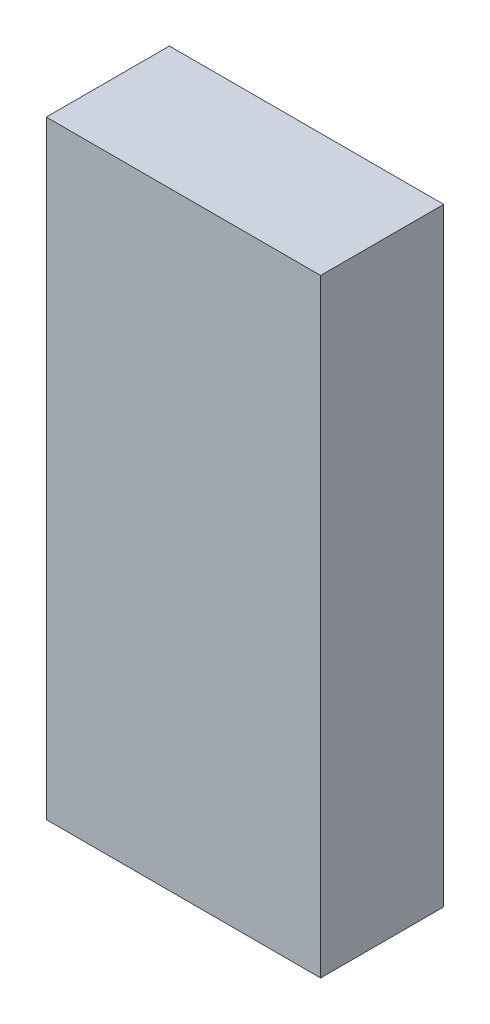
ISO-10303-21;
HEADER;
FILE_DESCRIPTION(('STEP AP214'),'2;1');
FILE_NAME('part.step','',(''),(''),'','','');
FILE_SCHEMA(('AUTOMOTIVE_DESIGN { 1 0 10303 214 1 1 1 1 }'));
ENDSEC;
DATA;
#1=APPLICATION_CONTEXT('core data for automotive mechanical design processes');
#2=APPLICATION_PROTOCOL_DEFINITION('international standard','automotive_design',2000,#1);
#3=PRODUCT_CONTEXT('',#1,'mechanical');
#4=PRODUCT('Part','Part','',(#3));
#5=PRODUCT_RELATED_PRODUCT_CATEGORY('part','',(#4));
#6=PRODUCT_DEFINITION_FORMATION('','',#4);
#7=PRODUCT_DEFINITION_CONTEXT('part definition',#1,'design');
#8=PRODUCT_DEFINITION('design','',#6,#7);
#9=PRODUCT_DEFINITION_SHAPE('','',#8);
#10=(LENGTH_UNIT() NAMED_UNIT(*) SI_UNIT(.MILLI.,.METRE.));
#11=(NAMED_UNIT(*) PLANE_ANGLE_UNIT() SI_UNIT($,.RADIAN.));
#12=(NAMED_UNIT(*) SI_UNIT($,.STERADIAN.) SOLID_ANGLE_UNIT());
#13=UNCERTAINTY_MEASURE_WITH_UNIT(LENGTH_MEASURE(1.E-05),#10,'distance_accuracy_value','');
#14=(GEOMETRIC_REPRESENTATION_CONTEXT(3) GLOBAL_UNCERTAINTY_ASSIGNED_CONTEXT((#13)) GLOBAL_UNIT_ASSIGNED_CONTEXT((#10,
#11,#12)) REPRESENTATION_CONTEXT('',''));
#15=CARTESIAN_POINT('',(0.,0.,0.));
#16=DIRECTION('',(0.,0.,1.));
#17=DIRECTION('',(1.,0.,0.));
#18=AXIS2_PLACEMENT_3D('',#15,#16,#17);
#19=CARTESIAN_POINT('',(-1.95000118,4.32500024,1.74999904));
#20=DIRECTION('',(0.,0.,1.));
#21=DIRECTION('',(1.,0.,0.));
#22=AXIS2_PLACEMENT_3D('',#19,#20,#21);
#23=PLANE('',#22);
#24=DIRECTION('',(0.,1.,0.));
#25=VECTOR('',#24,1.);
#26=CARTESIAN_POINT('',(1.95000118,4.32500024,1.74999904));
#27=LINE('',#26,#25);
#28=CARTESIAN_POINT('',(1.95000118,4.32500024,1.74999904));
#29=VERTEX_POINT('',#28);
#30=CARTESIAN_POINT('',(1.95000118,-4.32500024,1.74999904));
#31=VERTEX_POINT('',#30);
#32=EDGE_CURVE('E53',#29,#31,#27,.F.);
#33=ORIENTED_EDGE('',*,*,#32,.F.);
#34=DIRECTION('',(1.,0.,0.));
#35=VECTOR('',#34,1.);
#36=CARTESIAN_POINT('',(-1.95000118,4.32500024,1.74999904));
#37=LINE('',#36,#35);
#38=CARTESIAN_POINT('',(-1.95000118,4.32500024,1.74999904));
#39=VERTEX_POINT('',#38);
#40=EDGE_CURVE('E68',#39,#29,#37,.T.);
#41=ORIENTED_EDGE('',*,*,#40,.F.);
#42=DIRECTION('',(0.,1.,0.));
#43=VECTOR('',#42,1.);
#44=CARTESIAN_POINT('',(-1.95000118,-4.32500024,1.74999904));
#45=LINE('',#44,#43);
#46=CARTESIAN_POINT('',(-1.95000118,-4.32500024,1.74999904));
#47=VERTEX_POINT('',#46);
#48=EDGE_CURVE('E20',#47,#39,#45,.T.);
#49=ORIENTED_EDGE('',*,*,#48,.F.);
#50=DIRECTION('',(1.,0.,0.));
#51=VECTOR('',#50,1.);
#52=CARTESIAN_POINT('',(1.95000118,-4.32500024,1.74999904));
#53=LINE('',#52,#51);
#54=EDGE_CURVE('E58',#31,#47,#53,.F.);
#55=ORIENTED_EDGE('',*,*,#54,.F.);
#56=EDGE_LOOP('',(#33,#41,#49,#55));
#57=FACE_BOUND('',#56,.T.);
#58=ADVANCED_FACE('F17',(#57),#23,.T.);
#59=CARTESIAN_POINT('',(-1.95000118,-4.32500024,0.));
#60=DIRECTION('',(-1.,0.,0.));
#61=DIRECTION('',(0.,0.,1.));
#62=AXIS2_PLACEMENT_3D('',#59,#60,#61);
#63=PLANE('',#62);
#64=DIRECTION('',(0.,0.,1.));
#65=VECTOR('',#64,1.);
#66=CARTESIAN_POINT('',(-1.95000118,4.32500024,0.));
#67=LINE('',#66,#65);
#68=CARTESIAN_POINT('',(-1.95000118,4.32500024,0.));
#69=VERTEX_POINT('',#68);
#70=EDGE_CURVE('E79',#69,#39,#67,.T.);
#71=ORIENTED_EDGE('',*,*,#70,.F.);
#72=DIRECTION('',(0.,1.,0.));
#73=VECTOR('',#72,1.);
#74=CARTESIAN_POINT('',(-1.95000118,4.32500024,0.));
#75=LINE('',#74,#73);
#76=CARTESIAN_POINT('',(-1.95000118,-4.32500024,0.));
#77=VERTEX_POINT('',#76);
#78=EDGE_CURVE('E74',#69,#77,#75,.F.);
#79=ORIENTED_EDGE('',*,*,#78,.T.);
#80=DIRECTION('',(0.,0.,-1.));
#81=VECTOR('',#80,1.);
#82=CARTESIAN_POINT('',(-1.95000118,-4.32500024,0.));
#83=LINE('',#82,#81);
#84=EDGE_CURVE('E63',#47,#77,#83,.T.);
#85=ORIENTED_EDGE('',*,*,#84,.F.);
#86=ORIENTED_EDGE('',*,*,#48,.T.);
#87=EDGE_LOOP('',(#71,#79,#85,#86));
#88=FACE_BOUND('',#87,.T.);
#89=ADVANCED_FACE('F73',(#88),#63,.T.);
#90=CARTESIAN_POINT('',(1.95000118,-4.32500024,0.));
#91=DIRECTION('',(0.,-1.,0.));
#92=DIRECTION('',(0.,0.,-1.));
#93=AXIS2_PLACEMENT_3D('',#90,#91,#92);
#94=PLANE('',#93);
#95=ORIENTED_EDGE('',*,*,#84,.T.);
#96=DIRECTION('',(1.,0.,0.));
#97=VECTOR('',#96,1.);
#98=CARTESIAN_POINT('',(-1.95000118,-4.32500024,0.));
#99=LINE('',#98,#97);
#100=CARTESIAN_POINT('',(1.95000118,-4.32500024,0.));
#101=VERTEX_POINT('',#100);
#102=EDGE_CURVE('E84',#77,#101,#99,.T.);
#103=ORIENTED_EDGE('',*,*,#102,.T.);
#104=DIRECTION('',(0.,0.,-1.));
#105=VECTOR('',#104,1.);
#106=CARTESIAN_POINT('',(1.95000118,-4.32500024,0.));
#107=LINE('',#106,#105);
#108=EDGE_CURVE('E65',#31,#101,#107,.T.);
#109=ORIENTED_EDGE('',*,*,#108,.F.);
#110=ORIENTED_EDGE('',*,*,#54,.T.);
#111=EDGE_LOOP('',(#95,#103,#109,#110));
#112=FACE_BOUND('',#111,.T.);
#113=ADVANCED_FACE('F60',(#112),#94,.T.);
#114=CARTESIAN_POINT('',(1.95000118,4.32500024,0.));
#115=DIRECTION('',(1.,0.,0.));
#116=DIRECTION('',(0.,0.,-1.));
#117=AXIS2_PLACEMENT_3D('',#114,#115,#116);
#118=PLANE('',#117);
#119=ORIENTED_EDGE('',*,*,#108,.T.);
#120=DIRECTION('',(0.,1.,0.));
#121=VECTOR('',#120,1.);
#122=CARTESIAN_POINT('',(1.95000118,4.32500024,0.));
#123=LINE('',#122,#121);
#124=CARTESIAN_POINT('',(1.95000118,4.32500024,0.));
#125=VERTEX_POINT('',#124);
#126=EDGE_CURVE('E26',#101,#125,#123,.T.);
#127=ORIENTED_EDGE('',*,*,#126,.T.);
#128=DIRECTION('',(0.,0.,1.));
#129=VECTOR('',#128,1.);
#130=CARTESIAN_POINT('',(1.95000118,4.32500024,0.));
#131=LINE('',#130,#129);
#132=EDGE_CURVE('E34',#29,#125,#131,.F.);
#133=ORIENTED_EDGE('',*,*,#132,.F.);
#134=ORIENTED_EDGE('',*,*,#32,.T.);
#135=EDGE_LOOP('',(#119,#127,#133,#134));
#136=FACE_BOUND('',#135,.T.);
#137=ADVANCED_FACE('F88',(#136),#118,.T.);
#138=CARTESIAN_POINT('',(-1.95000118,4.32500024,0.));
#139=DIRECTION('',(0.,1.,0.));
#140=DIRECTION('',(0.,0.,1.));
#141=AXIS2_PLACEMENT_3D('',#138,#139,#140);
#142=PLANE('',#141);
#143=ORIENTED_EDGE('',*,*,#132,.T.);
#144=DIRECTION('',(1.,0.,0.));
#145=VECTOR('',#144,1.);
#146=CARTESIAN_POINT('',(-1.95000118,4.32500024,0.));
#147=LINE('',#146,#145);
#148=EDGE_CURVE('E11',#125,#69,#147,.F.);
#149=ORIENTED_EDGE('',*,*,#148,.T.);
#150=ORIENTED_EDGE('',*,*,#70,.T.);
#151=ORIENTED_EDGE('',*,*,#40,.T.);
#152=EDGE_LOOP('',(#143,#149,#150,#151));
#153=FACE_BOUND('',#152,.T.);
#154=ADVANCED_FACE('F91',(#153),#142,.T.);
#155=CARTESIAN_POINT('',(-1.95000118,4.32500024,0.));
#156=DIRECTION('',(0.,0.,1.));
#157=DIRECTION('',(1.,0.,0.));
#158=AXIS2_PLACEMENT_3D('',#155,#156,#157);
#159=PLANE('',#158);
#160=ORIENTED_EDGE('',*,*,#126,.F.);
#161=ORIENTED_EDGE('',*,*,#102,.F.);
#162=ORIENTED_EDGE('',*,*,#78,.F.);
#163=ORIENTED_EDGE('',*,*,#148,.F.);
#164=EDGE_LOOP('',(#160,#161,#162,#163));
#165=FACE_BOUND('',#164,.T.);
#166=ADVANCED_FACE('F90',(#165),#159,.F.);
#167=CLOSED_SHELL('',(#58,#89,#113,#137,#154,#166));
#168=MANIFOLD_SOLID_BREP('B1',#167);
#169=ADVANCED_BREP_SHAPE_REPRESENTATION('',(#18,#168),#14);
#170=SHAPE_DEFINITION_REPRESENTATION(#9,#169);
ENDSEC;
END-ISO-10303-21;
